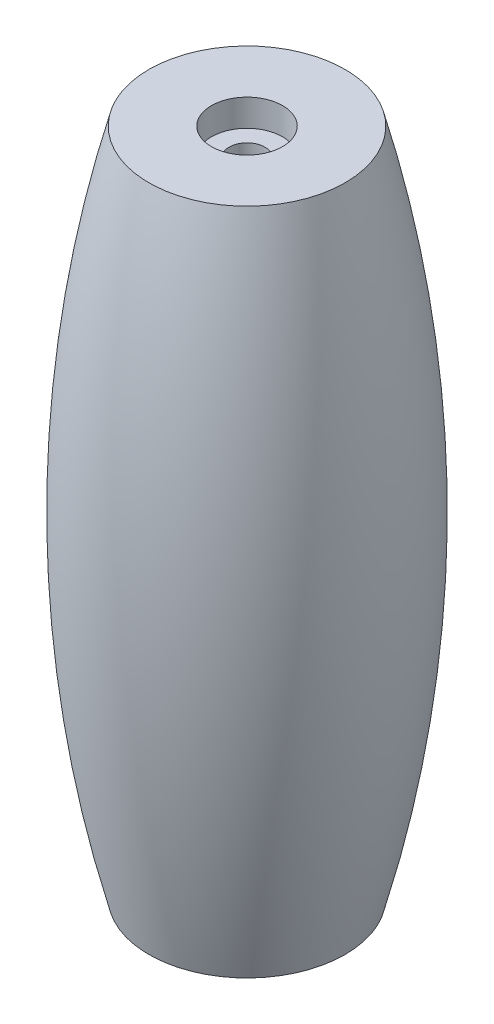
ISO-10303-21;
HEADER;
FILE_DESCRIPTION(('STEP AP214'),'2;1');
FILE_NAME('part.step','',(''),(''),'','','');
FILE_SCHEMA(('AUTOMOTIVE_DESIGN { 1 0 10303 214 1 1 1 1 }'));
ENDSEC;
DATA;
#1=APPLICATION_CONTEXT('core data for automotive mechanical design processes');
#2=APPLICATION_PROTOCOL_DEFINITION('international standard','automotive_design',2000,#1);
#3=PRODUCT_CONTEXT('',#1,'mechanical');
#4=PRODUCT('Part','Part','',(#3));
#5=PRODUCT_RELATED_PRODUCT_CATEGORY('part','',(#4));
#6=PRODUCT_DEFINITION_FORMATION('','',#4);
#7=PRODUCT_DEFINITION_CONTEXT('part definition',#1,'design');
#8=PRODUCT_DEFINITION('design','',#6,#7);
#9=PRODUCT_DEFINITION_SHAPE('','',#8);
#10=(LENGTH_UNIT() NAMED_UNIT(*) SI_UNIT(.MILLI.,.METRE.));
#11=(NAMED_UNIT(*) PLANE_ANGLE_UNIT() SI_UNIT($,.RADIAN.));
#12=(NAMED_UNIT(*) SI_UNIT($,.STERADIAN.) SOLID_ANGLE_UNIT());
#13=UNCERTAINTY_MEASURE_WITH_UNIT(LENGTH_MEASURE(1.E-05),#10,'distance_accuracy_value','');
#14=(GEOMETRIC_REPRESENTATION_CONTEXT(3) GLOBAL_UNCERTAINTY_ASSIGNED_CONTEXT((#13)) GLOBAL_UNIT_ASSIGNED_CONTEXT((#10,
#11,#12)) REPRESENTATION_CONTEXT('',''));
#15=CARTESIAN_POINT('',(0.,0.,0.));
#16=DIRECTION('',(0.,0.,1.));
#17=DIRECTION('',(1.,0.,0.));
#18=AXIS2_PLACEMENT_3D('',#15,#16,#17);
#19=CARTESIAN_POINT('',(-19.0896786785979,-31.5091057655142,0.));
#20=DIRECTION('',(0.,1.,0.));
#21=DIRECTION('',(-1.,0.,0.));
#22=AXIS2_PLACEMENT_3D('',#19,#20,#21);
#23=CYLINDRICAL_SURFACE('',#22,1.175);
#24=CARTESIAN_POINT('',(-19.0896786785979,-29.7231057655142,0.));
#25=DIRECTION('',(0.,-1.,0.));
#26=DIRECTION('',(1.,0.,0.));
#27=AXIS2_PLACEMENT_3D('',#24,#25,#26);
#28=CIRCLE('',#27,1.175);
#29=CARTESIAN_POINT('',(-17.9146786785979,-29.7231057655142,0.));
#30=VERTEX_POINT('',#29);
#31=EDGE_CURVE('E47',#30,#30,#28,.F.);
#32=ORIENTED_EDGE('',*,*,#31,.F.);
#33=EDGE_LOOP('',(#32));
#34=FACE_BOUND('',#33,.T.);
#35=CARTESIAN_POINT('',(-19.0896786785979,10.8848942344858,0.));
#36=DIRECTION('',(0.,1.,0.));
#37=DIRECTION('',(-1.,0.,0.));
#38=AXIS2_PLACEMENT_3D('',#35,#36,#37);
#39=CIRCLE('',#38,1.175);
#40=CARTESIAN_POINT('',(-20.2646786785979,10.8848942344858,0.));
#41=VERTEX_POINT('',#40);
#42=EDGE_CURVE('E38',#41,#41,#39,.F.);
#43=ORIENTED_EDGE('',*,*,#42,.F.);
#44=EDGE_LOOP('',(#43));
#45=FACE_BOUND('',#44,.T.);
#46=ADVANCED_FACE('F34',(#34,#45),#23,.F.);
#47=CARTESIAN_POINT('',(-19.089678678598,-9.41910576551423,0.));
#48=DIRECTION('',(0.,1.,0.));
#49=DIRECTION('',(-1.,0.,0.));
#50=AXIS2_PLACEMENT_3D('',#47,#48,#49);
#51=DEGENERATE_TOROIDAL_SURFACE('',#50,76.9844863119006,86.3454912187109,.F.);
#52=CARTESIAN_POINT('',(-19.0896786785979,-31.5091057655142,0.));
#53=DIRECTION('',(0.,1.,0.));
#54=DIRECTION('',(-1.,0.,0.));
#55=AXIS2_PLACEMENT_3D('',#52,#53,#54);
#56=CIRCLE('',#55,6.48751949723563);
#57=CARTESIAN_POINT('',(-25.5771981758336,-31.5091057655142,0.));
#58=VERTEX_POINT('',#57);
#59=EDGE_CURVE('E42',#58,#58,#56,.T.);
#60=ORIENTED_EDGE('',*,*,#59,.T.);
#61=EDGE_LOOP('',(#60));
#62=FACE_BOUND('',#61,.T.);
#63=CARTESIAN_POINT('',(-19.0896786785979,12.6708942344858,0.));
#64=DIRECTION('',(0.,1.,0.));
#65=DIRECTION('',(-1.,0.,0.));
#66=AXIS2_PLACEMENT_3D('',#63,#64,#65);
#67=CIRCLE('',#66,6.48751949723563);
#68=CARTESIAN_POINT('',(-25.5771981758336,12.6708942344858,0.));
#69=VERTEX_POINT('',#68);
#70=EDGE_CURVE('E10',#69,#69,#67,.T.);
#71=ORIENTED_EDGE('',*,*,#70,.F.);
#72=EDGE_LOOP('',(#71));
#73=FACE_BOUND('',#72,.T.);
#74=ADVANCED_FACE('F36',(#62,#73),#51,.F.);
#75=CARTESIAN_POINT('',(-1.14538072071588,12.6708942344858,0.));
#76=DIRECTION('',(0.,1.,0.));
#77=DIRECTION('',(-1.,0.,0.));
#78=AXIS2_PLACEMENT_3D('',#75,#76,#77);
#79=PLANE('',#78);
#80=CARTESIAN_POINT('',(-19.0896786785979,12.6708942344858,0.));
#81=DIRECTION('',(0.,1.,0.));
#82=DIRECTION('',(-1.,0.,0.));
#83=AXIS2_PLACEMENT_3D('',#80,#81,#82);
#84=CIRCLE('',#83,2.35);
#85=CARTESIAN_POINT('',(-21.4396786785979,12.6708942344858,0.));
#86=VERTEX_POINT('',#85);
#87=EDGE_CURVE('E61',#86,#86,#84,.T.);
#88=ORIENTED_EDGE('',*,*,#87,.F.);
#89=EDGE_LOOP('',(#88));
#90=FACE_BOUND('',#89,.T.);
#91=ORIENTED_EDGE('',*,*,#70,.T.);
#92=EDGE_LOOP('',(#91));
#93=FACE_BOUND('',#92,.T.);
#94=ADVANCED_FACE('F79',(#90,#93),#79,.T.);
#95=CARTESIAN_POINT('',(-1.14538072071587,-31.5091057655142,0.));
#96=DIRECTION('',(0.,1.,0.));
#97=DIRECTION('',(-1.,0.,0.));
#98=AXIS2_PLACEMENT_3D('',#95,#96,#97);
#99=PLANE('',#98);
#100=CARTESIAN_POINT('',(-19.0896786785979,-31.5091057655142,0.));
#101=DIRECTION('',(0.,-1.,0.));
#102=DIRECTION('',(1.,0.,0.));
#103=AXIS2_PLACEMENT_3D('',#100,#101,#102);
#104=CIRCLE('',#103,2.35);
#105=CARTESIAN_POINT('',(-16.7396786785979,-31.5091057655142,0.));
#106=VERTEX_POINT('',#105);
#107=EDGE_CURVE('E55',#106,#106,#104,.T.);
#108=ORIENTED_EDGE('',*,*,#107,.F.);
#109=EDGE_LOOP('',(#108));
#110=FACE_BOUND('',#109,.T.);
#111=ORIENTED_EDGE('',*,*,#59,.F.);
#112=EDGE_LOOP('',(#111));
#113=FACE_BOUND('',#112,.T.);
#114=ADVANCED_FACE('F85',(#110,#113),#99,.F.);
#115=CARTESIAN_POINT('',(-19.0896786785979,-29.7231057655142,0.));
#116=DIRECTION('',(0.,-1.,0.));
#117=DIRECTION('',(1.,0.,0.));
#118=AXIS2_PLACEMENT_3D('',#115,#116,#117);
#119=PLANE('',#118);
#120=CARTESIAN_POINT('',(-19.0896786785979,-29.7231057655142,0.));
#121=DIRECTION('',(0.,-1.,0.));
#122=DIRECTION('',(1.,0.,0.));
#123=AXIS2_PLACEMENT_3D('',#120,#121,#122);
#124=CIRCLE('',#123,2.35);
#125=CARTESIAN_POINT('',(-16.7396786785979,-29.7231057655142,0.));
#126=VERTEX_POINT('',#125);
#127=EDGE_CURVE('E51',#126,#126,#124,.T.);
#128=ORIENTED_EDGE('',*,*,#127,.T.);
#129=EDGE_LOOP('',(#128));
#130=FACE_BOUND('',#129,.T.);
#131=ORIENTED_EDGE('',*,*,#31,.T.);
#132=EDGE_LOOP('',(#131));
#133=FACE_BOUND('',#132,.T.);
#134=ADVANCED_FACE('F87',(#130,#133),#119,.T.);
#135=CARTESIAN_POINT('',(-19.0896786785979,-29.7231057655142,0.));
#136=DIRECTION('',(0.,-1.,0.));
#137=DIRECTION('',(1.,0.,0.));
#138=AXIS2_PLACEMENT_3D('',#135,#136,#137);
#139=CYLINDRICAL_SURFACE('',#138,2.35);
#140=ORIENTED_EDGE('',*,*,#127,.F.);
#141=EDGE_LOOP('',(#140));
#142=FACE_BOUND('',#141,.T.);
#143=ORIENTED_EDGE('',*,*,#107,.T.);
#144=EDGE_LOOP('',(#143));
#145=FACE_BOUND('',#144,.T.);
#146=ADVANCED_FACE('F83',(#142,#145),#139,.F.);
#147=CARTESIAN_POINT('',(-19.0896786785979,10.8848942344858,0.));
#148=DIRECTION('',(0.,1.,0.));
#149=DIRECTION('',(-1.,0.,0.));
#150=AXIS2_PLACEMENT_3D('',#147,#148,#149);
#151=PLANE('',#150);
#152=CARTESIAN_POINT('',(-19.0896786785979,10.8848942344858,0.));
#153=DIRECTION('',(0.,1.,0.));
#154=DIRECTION('',(-1.,0.,0.));
#155=AXIS2_PLACEMENT_3D('',#152,#153,#154);
#156=CIRCLE('',#155,2.35);
#157=CARTESIAN_POINT('',(-21.4396786785979,10.8848942344858,0.));
#158=VERTEX_POINT('',#157);
#159=EDGE_CURVE('E64',#158,#158,#156,.T.);
#160=ORIENTED_EDGE('',*,*,#159,.T.);
#161=EDGE_LOOP('',(#160));
#162=FACE_BOUND('',#161,.T.);
#163=ORIENTED_EDGE('',*,*,#42,.T.);
#164=EDGE_LOOP('',(#163));
#165=FACE_BOUND('',#164,.T.);
#166=ADVANCED_FACE('F71',(#162,#165),#151,.T.);
#167=CARTESIAN_POINT('',(-19.0896786785979,10.8848942344858,0.));
#168=DIRECTION('',(0.,1.,0.));
#169=DIRECTION('',(-1.,0.,0.));
#170=AXIS2_PLACEMENT_3D('',#167,#168,#169);
#171=CYLINDRICAL_SURFACE('',#170,2.35);
#172=ORIENTED_EDGE('',*,*,#159,.F.);
#173=EDGE_LOOP('',(#172));
#174=FACE_BOUND('',#173,.T.);
#175=ORIENTED_EDGE('',*,*,#87,.T.);
#176=EDGE_LOOP('',(#175));
#177=FACE_BOUND('',#176,.T.);
#178=ADVANCED_FACE('F95',(#174,#177),#171,.F.);
#179=CLOSED_SHELL('',(#46,#74,#94,#114,#134,#146,#166,#178));
#180=MANIFOLD_SOLID_BREP('B2',#179);
#181=ADVANCED_BREP_SHAPE_REPRESENTATION('',(#18,#180),#14);
#182=SHAPE_DEFINITION_REPRESENTATION(#9,#181);
ENDSEC;
END-ISO-10303-21;
